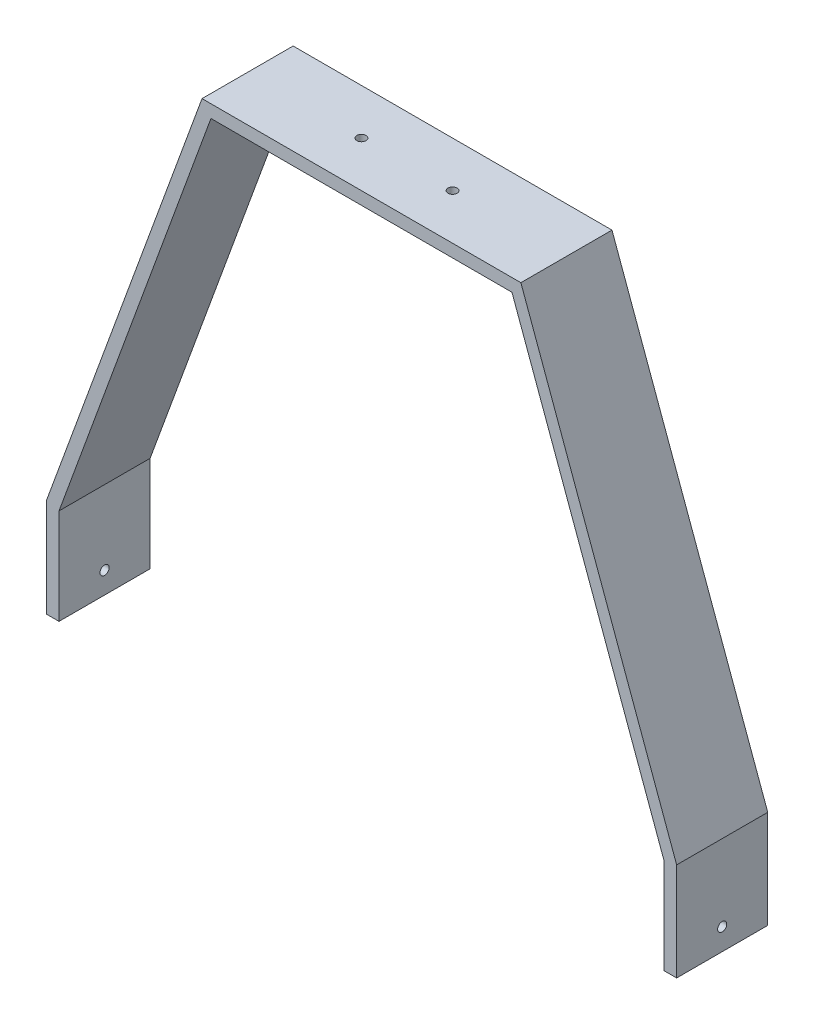
ISO-10303-21;
HEADER;
FILE_DESCRIPTION(('STEP AP214'),'2;1');
FILE_NAME('part.step','',(''),(''),'','','');
FILE_SCHEMA(('AUTOMOTIVE_DESIGN { 1 0 10303 214 1 1 1 1 }'));
ENDSEC;
DATA;
#1=APPLICATION_CONTEXT('core data for automotive mechanical design processes');
#2=APPLICATION_PROTOCOL_DEFINITION('international standard','automotive_design',2000,#1);
#3=PRODUCT_CONTEXT('',#1,'mechanical');
#4=PRODUCT('Part','Part','',(#3));
#5=PRODUCT_RELATED_PRODUCT_CATEGORY('part','',(#4));
#6=PRODUCT_DEFINITION_FORMATION('','',#4);
#7=PRODUCT_DEFINITION_CONTEXT('part definition',#1,'design');
#8=PRODUCT_DEFINITION('design','',#6,#7);
#9=PRODUCT_DEFINITION_SHAPE('','',#8);
#10=(LENGTH_UNIT() NAMED_UNIT(*) SI_UNIT(.MILLI.,.METRE.));
#11=(NAMED_UNIT(*) PLANE_ANGLE_UNIT() SI_UNIT($,.RADIAN.));
#12=(NAMED_UNIT(*) SI_UNIT($,.STERADIAN.) SOLID_ANGLE_UNIT());
#13=UNCERTAINTY_MEASURE_WITH_UNIT(LENGTH_MEASURE(1.E-05),#10,'distance_accuracy_value','');
#14=(GEOMETRIC_REPRESENTATION_CONTEXT(3) GLOBAL_UNCERTAINTY_ASSIGNED_CONTEXT((#13)) GLOBAL_UNIT_ASSIGNED_CONTEXT((#10,
#11,#12)) REPRESENTATION_CONTEXT('',''));
#15=CARTESIAN_POINT('',(0.,0.,0.));
#16=DIRECTION('',(0.,0.,1.));
#17=DIRECTION('',(1.,0.,0.));
#18=AXIS2_PLACEMENT_3D('',#15,#16,#17);
#19=CARTESIAN_POINT('',(0.,0.,50.));
#20=DIRECTION('',(0.,-1.,0.));
#21=DIRECTION('',(0.,0.,-1.));
#22=AXIS2_PLACEMENT_3D('',#19,#20,#21);
#23=PLANE('',#22);
#24=CARTESIAN_POINT('',(112.5,0.,25.));
#25=DIRECTION('',(0.,1.,0.));
#26=DIRECTION('',(0.,0.,1.));
#27=AXIS2_PLACEMENT_3D('',#24,#25,#26);
#28=CIRCLE('',#27,2.5);
#29=CARTESIAN_POINT('',(112.5,0.,27.5));
#30=VERTEX_POINT('',#29);
#31=EDGE_CURVE('E237',#30,#30,#28,.T.);
#32=ORIENTED_EDGE('',*,*,#31,.F.);
#33=EDGE_LOOP('',(#32));
#34=FACE_BOUND('',#33,.T.);
#35=CARTESIAN_POINT('',(62.5,0.,25.));
#36=DIRECTION('',(0.,1.,0.));
#37=DIRECTION('',(0.,0.,1.));
#38=AXIS2_PLACEMENT_3D('',#35,#36,#37);
#39=CIRCLE('',#38,2.5);
#40=CARTESIAN_POINT('',(62.5,0.,27.5));
#41=VERTEX_POINT('',#40);
#42=EDGE_CURVE('E245',#41,#41,#39,.T.);
#43=ORIENTED_EDGE('',*,*,#42,.F.);
#44=EDGE_LOOP('',(#43));
#45=FACE_BOUND('',#44,.T.);
#46=DIRECTION('',(-1.,0.,0.));
#47=VECTOR('',#46,1.);
#48=CARTESIAN_POINT('',(0.,0.,0.));
#49=LINE('',#48,#47);
#50=CARTESIAN_POINT('',(175.,0.,0.));
#51=VERTEX_POINT('',#50);
#52=CARTESIAN_POINT('',(0.,0.,0.));
#53=VERTEX_POINT('',#52);
#54=EDGE_CURVE('E166',#51,#53,#49,.T.);
#55=ORIENTED_EDGE('',*,*,#54,.T.);
#56=DIRECTION('',(0.,0.,-1.));
#57=VECTOR('',#56,1.);
#58=CARTESIAN_POINT('',(0.,0.,50.));
#59=LINE('',#58,#57);
#60=CARTESIAN_POINT('',(0.,0.,50.));
#61=VERTEX_POINT('',#60);
#62=EDGE_CURVE('E11',#61,#53,#59,.T.);
#63=ORIENTED_EDGE('',*,*,#62,.F.);
#64=DIRECTION('',(-1.,0.,0.));
#65=VECTOR('',#64,1.);
#66=CARTESIAN_POINT('',(0.,0.,50.));
#67=LINE('',#66,#65);
#68=CARTESIAN_POINT('',(175.,0.,50.));
#69=VERTEX_POINT('',#68);
#70=EDGE_CURVE('E201',#69,#61,#67,.T.);
#71=ORIENTED_EDGE('',*,*,#70,.F.);
#72=DIRECTION('',(0.,0.,-1.));
#73=VECTOR('',#72,1.);
#74=CARTESIAN_POINT('',(175.,0.,50.));
#75=LINE('',#74,#73);
#76=EDGE_CURVE('E162',#69,#51,#75,.T.);
#77=ORIENTED_EDGE('',*,*,#76,.T.);
#78=EDGE_LOOP('',(#55,#63,#71,#77));
#79=FACE_BOUND('',#78,.T.);
#80=ADVANCED_FACE('F39',(#34,#45,#79),#23,.F.);
#81=CARTESIAN_POINT('',(0.,0.,50.));
#82=DIRECTION('',(0.939264923790738,-0.343192952923539,0.));
#83=DIRECTION('',(0.343192952923539,0.939264923790739,0.));
#84=AXIS2_PLACEMENT_3D('',#81,#82,#83);
#85=PLANE('',#84);
#86=DIRECTION('',(-0.343192952923539,-0.939264923790738,0.));
#87=VECTOR('',#86,1.);
#88=CARTESIAN_POINT('',(0.,0.,0.));
#89=LINE('',#88,#87);
#90=CARTESIAN_POINT('',(-85.5,-234.,0.));
#91=VERTEX_POINT('',#90);
#92=EDGE_CURVE('E170',#53,#91,#89,.T.);
#93=ORIENTED_EDGE('',*,*,#92,.T.);
#94=DIRECTION('',(0.,0.,-1.));
#95=VECTOR('',#94,1.);
#96=CARTESIAN_POINT('',(-85.5,-234.,50.));
#97=LINE('',#96,#95);
#98=CARTESIAN_POINT('',(-85.5,-234.,50.));
#99=VERTEX_POINT('',#98);
#100=EDGE_CURVE('E49',#99,#91,#97,.T.);
#101=ORIENTED_EDGE('',*,*,#100,.F.);
#102=DIRECTION('',(-0.343192952923539,-0.939264923790738,0.));
#103=VECTOR('',#102,1.);
#104=CARTESIAN_POINT('',(0.,0.,50.));
#105=LINE('',#104,#103);
#106=EDGE_CURVE('E113',#61,#99,#105,.T.);
#107=ORIENTED_EDGE('',*,*,#106,.F.);
#108=ORIENTED_EDGE('',*,*,#62,.T.);
#109=EDGE_LOOP('',(#93,#101,#107,#108));
#110=FACE_BOUND('',#109,.T.);
#111=ADVANCED_FACE('F318',(#110),#85,.F.);
#112=CARTESIAN_POINT('',(-85.5,-234.,50.));
#113=DIRECTION('',(1.,0.,0.));
#114=DIRECTION('',(0.,1.,0.));
#115=AXIS2_PLACEMENT_3D('',#112,#113,#114);
#116=PLANE('',#115);
#117=CARTESIAN_POINT('',(-85.5,-275.891246781146,25.));
#118=DIRECTION('',(1.,0.,0.));
#119=DIRECTION('',(0.,0.,-1.));
#120=AXIS2_PLACEMENT_3D('',#117,#118,#119);
#121=CIRCLE('',#120,2.5);
#122=CARTESIAN_POINT('',(-85.5,-275.891246781146,22.5));
#123=VERTEX_POINT('',#122);
#124=EDGE_CURVE('E253',#123,#123,#121,.T.);
#125=ORIENTED_EDGE('',*,*,#124,.T.);
#126=EDGE_LOOP('',(#125));
#127=FACE_BOUND('',#126,.T.);
#128=DIRECTION('',(0.,-1.,0.));
#129=VECTOR('',#128,1.);
#130=CARTESIAN_POINT('',(-85.5,-234.,0.));
#131=LINE('',#130,#129);
#132=CARTESIAN_POINT('',(-85.5,-287.757501625386,0.));
#133=VERTEX_POINT('',#132);
#134=EDGE_CURVE('E174',#91,#133,#131,.T.);
#135=ORIENTED_EDGE('',*,*,#134,.T.);
#136=DIRECTION('',(0.,0.,-1.));
#137=VECTOR('',#136,1.);
#138=CARTESIAN_POINT('',(-85.5,-287.757501625386,50.));
#139=LINE('',#138,#137);
#140=CARTESIAN_POINT('',(-85.5,-287.757501625386,50.));
#141=VERTEX_POINT('',#140);
#142=EDGE_CURVE('E228',#141,#133,#139,.T.);
#143=ORIENTED_EDGE('',*,*,#142,.F.);
#144=DIRECTION('',(0.,-1.,0.));
#145=VECTOR('',#144,1.);
#146=CARTESIAN_POINT('',(-85.5,-234.,50.));
#147=LINE('',#146,#145);
#148=EDGE_CURVE('E271',#99,#141,#147,.T.);
#149=ORIENTED_EDGE('',*,*,#148,.F.);
#150=ORIENTED_EDGE('',*,*,#100,.T.);
#151=EDGE_LOOP('',(#135,#143,#149,#150));
#152=FACE_BOUND('',#151,.T.);
#153=ADVANCED_FACE('F323',(#127,#152),#116,.F.);
#154=CARTESIAN_POINT('',(-85.5,-287.757501625386,50.));
#155=DIRECTION('',(0.,1.,0.));
#156=DIRECTION('',(-1.,0.,0.));
#157=AXIS2_PLACEMENT_3D('',#154,#155,#156);
#158=PLANE('',#157);
#159=DIRECTION('',(1.,0.,0.));
#160=VECTOR('',#159,1.);
#161=CARTESIAN_POINT('',(-85.5,-287.757501625386,0.));
#162=LINE('',#161,#160);
#163=CARTESIAN_POINT('',(-78.5,-287.757501625386,0.));
#164=VERTEX_POINT('',#163);
#165=EDGE_CURVE('E177',#133,#164,#162,.T.);
#166=ORIENTED_EDGE('',*,*,#165,.T.);
#167=DIRECTION('',(0.,0.,-1.));
#168=VECTOR('',#167,1.);
#169=CARTESIAN_POINT('',(-78.5,-287.757501625386,50.));
#170=LINE('',#169,#168);
#171=CARTESIAN_POINT('',(-78.5,-287.757501625386,50.));
#172=VERTEX_POINT('',#171);
#173=EDGE_CURVE('E224',#172,#164,#170,.T.);
#174=ORIENTED_EDGE('',*,*,#173,.F.);
#175=DIRECTION('',(1.,0.,0.));
#176=VECTOR('',#175,1.);
#177=CARTESIAN_POINT('',(-85.5,-287.757501625386,50.));
#178=LINE('',#177,#176);
#179=EDGE_CURVE('E274',#141,#172,#178,.T.);
#180=ORIENTED_EDGE('',*,*,#179,.F.);
#181=ORIENTED_EDGE('',*,*,#142,.T.);
#182=EDGE_LOOP('',(#166,#174,#180,#181));
#183=FACE_BOUND('',#182,.T.);
#184=ADVANCED_FACE('F372',(#183),#158,.F.);
#185=CARTESIAN_POINT('',(-78.5,-235.238794473614,50.));
#186=DIRECTION('',(-1.,0.,0.));
#187=DIRECTION('',(0.,0.,1.));
#188=AXIS2_PLACEMENT_3D('',#185,#186,#187);
#189=PLANE('',#188);
#190=CARTESIAN_POINT('',(-78.5,-275.891246781146,25.));
#191=DIRECTION('',(-1.,0.,0.));
#192=DIRECTION('',(0.,0.,1.));
#193=AXIS2_PLACEMENT_3D('',#190,#191,#192);
#194=CIRCLE('',#193,2.5);
#195=CARTESIAN_POINT('',(-78.5,-275.891246781146,27.5));
#196=VERTEX_POINT('',#195);
#197=EDGE_CURVE('E171',#196,#196,#194,.T.);
#198=ORIENTED_EDGE('',*,*,#197,.T.);
#199=EDGE_LOOP('',(#198));
#200=FACE_BOUND('',#199,.T.);
#201=DIRECTION('',(0.,1.,0.));
#202=VECTOR('',#201,1.);
#203=CARTESIAN_POINT('',(-78.5,-235.238794473614,0.));
#204=LINE('',#203,#202);
#205=CARTESIAN_POINT('',(-78.5,-235.238794473614,0.));
#206=VERTEX_POINT('',#205);
#207=EDGE_CURVE('E180',#164,#206,#204,.T.);
#208=ORIENTED_EDGE('',*,*,#207,.T.);
#209=DIRECTION('',(0.,0.,-1.));
#210=VECTOR('',#209,1.);
#211=CARTESIAN_POINT('',(-78.5,-235.238794473614,50.));
#212=LINE('',#211,#210);
#213=CARTESIAN_POINT('',(-78.5,-235.238794473614,50.));
#214=VERTEX_POINT('',#213);
#215=EDGE_CURVE('E220',#214,#206,#212,.T.);
#216=ORIENTED_EDGE('',*,*,#215,.F.);
#217=DIRECTION('',(0.,1.,0.));
#218=VECTOR('',#217,1.);
#219=CARTESIAN_POINT('',(-78.5,-235.238794473614,50.));
#220=LINE('',#219,#218);
#221=EDGE_CURVE('E277',#172,#214,#220,.T.);
#222=ORIENTED_EDGE('',*,*,#221,.F.);
#223=ORIENTED_EDGE('',*,*,#173,.T.);
#224=EDGE_LOOP('',(#208,#216,#222,#223));
#225=FACE_BOUND('',#224,.T.);
#226=ADVANCED_FACE('F368',(#200,#225),#189,.F.);
#227=CARTESIAN_POINT('',(4.8949441345896,-7.00000000000002,50.));
#228=DIRECTION('',(-0.939264923790739,0.343192952923539,0.));
#229=DIRECTION('',(-0.343192952923539,-0.939264923790738,0.));
#230=AXIS2_PLACEMENT_3D('',#227,#228,#229);
#231=PLANE('',#230);
#232=DIRECTION('',(0.343192952923539,0.939264923790738,0.));
#233=VECTOR('',#232,1.);
#234=CARTESIAN_POINT('',(4.8949441345896,-7.00000000000002,0.));
#235=LINE('',#234,#233);
#236=CARTESIAN_POINT('',(4.8949441345896,-7.00000000000002,0.));
#237=VERTEX_POINT('',#236);
#238=EDGE_CURVE('E183',#206,#237,#235,.T.);
#239=ORIENTED_EDGE('',*,*,#238,.T.);
#240=DIRECTION('',(0.,0.,-1.));
#241=VECTOR('',#240,1.);
#242=CARTESIAN_POINT('',(4.8949441345896,-7.00000000000002,50.));
#243=LINE('',#242,#241);
#244=CARTESIAN_POINT('',(4.8949441345896,-7.00000000000002,50.));
#245=VERTEX_POINT('',#244);
#246=EDGE_CURVE('E216',#245,#237,#243,.T.);
#247=ORIENTED_EDGE('',*,*,#246,.F.);
#248=DIRECTION('',(0.343192952923539,0.939264923790738,0.));
#249=VECTOR('',#248,1.);
#250=CARTESIAN_POINT('',(4.8949441345896,-7.00000000000002,50.));
#251=LINE('',#250,#249);
#252=EDGE_CURVE('E280',#214,#245,#251,.T.);
#253=ORIENTED_EDGE('',*,*,#252,.F.);
#254=ORIENTED_EDGE('',*,*,#215,.T.);
#255=EDGE_LOOP('',(#239,#247,#253,#254));
#256=FACE_BOUND('',#255,.T.);
#257=ADVANCED_FACE('F364',(#256),#231,.F.);
#258=CARTESIAN_POINT('',(170.10505586541,-7.00000000000002,50.));
#259=DIRECTION('',(0.,1.,0.));
#260=DIRECTION('',(0.,0.,1.));
#261=AXIS2_PLACEMENT_3D('',#258,#259,#260);
#262=PLANE('',#261);
#263=CARTESIAN_POINT('',(112.5,-7.00000000000001,25.));
#264=DIRECTION('',(0.,1.,0.));
#265=DIRECTION('',(0.,0.,1.));
#266=AXIS2_PLACEMENT_3D('',#263,#264,#265);
#267=CIRCLE('',#266,2.5);
#268=CARTESIAN_POINT('',(112.5,-7.00000000000001,27.5));
#269=VERTEX_POINT('',#268);
#270=EDGE_CURVE('E42',#269,#269,#267,.T.);
#271=ORIENTED_EDGE('',*,*,#270,.T.);
#272=EDGE_LOOP('',(#271));
#273=FACE_BOUND('',#272,.T.);
#274=CARTESIAN_POINT('',(62.5,-7.00000000000001,25.));
#275=DIRECTION('',(0.,1.,0.));
#276=DIRECTION('',(0.,0.,1.));
#277=AXIS2_PLACEMENT_3D('',#274,#275,#276);
#278=CIRCLE('',#277,2.5);
#279=CARTESIAN_POINT('',(62.5,-7.00000000000001,27.5));
#280=VERTEX_POINT('',#279);
#281=EDGE_CURVE('E234',#280,#280,#278,.T.);
#282=ORIENTED_EDGE('',*,*,#281,.T.);
#283=EDGE_LOOP('',(#282));
#284=FACE_BOUND('',#283,.T.);
#285=DIRECTION('',(1.,0.,0.));
#286=VECTOR('',#285,1.);
#287=CARTESIAN_POINT('',(170.10505586541,-7.00000000000002,0.));
#288=LINE('',#287,#286);
#289=CARTESIAN_POINT('',(170.10505586541,-7.00000000000002,0.));
#290=VERTEX_POINT('',#289);
#291=EDGE_CURVE('E186',#237,#290,#288,.T.);
#292=ORIENTED_EDGE('',*,*,#291,.T.);
#293=DIRECTION('',(0.,0.,-1.));
#294=VECTOR('',#293,1.);
#295=CARTESIAN_POINT('',(170.10505586541,-7.00000000000002,50.));
#296=LINE('',#295,#294);
#297=CARTESIAN_POINT('',(170.10505586541,-7.00000000000002,50.));
#298=VERTEX_POINT('',#297);
#299=EDGE_CURVE('E212',#298,#290,#296,.T.);
#300=ORIENTED_EDGE('',*,*,#299,.F.);
#301=DIRECTION('',(1.,0.,0.));
#302=VECTOR('',#301,1.);
#303=CARTESIAN_POINT('',(170.10505586541,-7.00000000000002,50.));
#304=LINE('',#303,#302);
#305=EDGE_CURVE('E283',#245,#298,#304,.T.);
#306=ORIENTED_EDGE('',*,*,#305,.F.);
#307=ORIENTED_EDGE('',*,*,#246,.T.);
#308=EDGE_LOOP('',(#292,#300,#306,#307));
#309=FACE_BOUND('',#308,.T.);
#310=ADVANCED_FACE('F359',(#273,#284,#309),#262,.F.);
#311=CARTESIAN_POINT('',(170.10505586541,-7.00000000000002,50.));
#312=DIRECTION('',(0.939264923790738,0.343192952923539,0.));
#313=DIRECTION('',(-0.343192952923539,0.939264923790738,0.));
#314=AXIS2_PLACEMENT_3D('',#311,#312,#313);
#315=PLANE('',#314);
#316=DIRECTION('',(0.343192952923539,-0.939264923790738,0.));
#317=VECTOR('',#316,1.);
#318=CARTESIAN_POINT('',(170.10505586541,-7.00000000000002,0.));
#319=LINE('',#318,#317);
#320=CARTESIAN_POINT('',(253.5,-235.238794473614,0.));
#321=VERTEX_POINT('',#320);
#322=EDGE_CURVE('E189',#290,#321,#319,.T.);
#323=ORIENTED_EDGE('',*,*,#322,.T.);
#324=DIRECTION('',(0.,0.,-1.));
#325=VECTOR('',#324,1.);
#326=CARTESIAN_POINT('',(253.5,-235.238794473614,50.));
#327=LINE('',#326,#325);
#328=CARTESIAN_POINT('',(253.5,-235.238794473614,50.));
#329=VERTEX_POINT('',#328);
#330=EDGE_CURVE('E208',#329,#321,#327,.T.);
#331=ORIENTED_EDGE('',*,*,#330,.F.);
#332=DIRECTION('',(0.343192952923539,-0.939264923790738,0.));
#333=VECTOR('',#332,1.);
#334=CARTESIAN_POINT('',(170.10505586541,-7.00000000000002,50.));
#335=LINE('',#334,#333);
#336=EDGE_CURVE('E286',#298,#329,#335,.T.);
#337=ORIENTED_EDGE('',*,*,#336,.F.);
#338=ORIENTED_EDGE('',*,*,#299,.T.);
#339=EDGE_LOOP('',(#323,#331,#337,#338));
#340=FACE_BOUND('',#339,.T.);
#341=ADVANCED_FACE('F294',(#340),#315,.F.);
#342=CARTESIAN_POINT('',(253.5,-235.238794473614,50.));
#343=DIRECTION('',(1.,0.,0.));
#344=DIRECTION('',(0.,0.,-1.));
#345=AXIS2_PLACEMENT_3D('',#342,#343,#344);
#346=PLANE('',#345);
#347=CARTESIAN_POINT('',(253.5,-275.891246781146,25.));
#348=DIRECTION('',(1.,0.,0.));
#349=DIRECTION('',(0.,0.,-1.));
#350=AXIS2_PLACEMENT_3D('',#347,#348,#349);
#351=CIRCLE('',#350,2.5);
#352=CARTESIAN_POINT('',(253.5,-275.891246781146,22.5));
#353=VERTEX_POINT('',#352);
#354=EDGE_CURVE('E257',#353,#353,#351,.T.);
#355=ORIENTED_EDGE('',*,*,#354,.T.);
#356=EDGE_LOOP('',(#355));
#357=FACE_BOUND('',#356,.T.);
#358=DIRECTION('',(0.,-1.,0.));
#359=VECTOR('',#358,1.);
#360=CARTESIAN_POINT('',(253.5,-235.238794473614,0.));
#361=LINE('',#360,#359);
#362=CARTESIAN_POINT('',(253.5,-287.757501625386,0.));
#363=VERTEX_POINT('',#362);
#364=EDGE_CURVE('E192',#321,#363,#361,.T.);
#365=ORIENTED_EDGE('',*,*,#364,.T.);
#366=DIRECTION('',(0.,0.,-1.));
#367=VECTOR('',#366,1.);
#368=CARTESIAN_POINT('',(253.5,-287.757501625386,50.));
#369=LINE('',#368,#367);
#370=CARTESIAN_POINT('',(253.5,-287.757501625386,50.));
#371=VERTEX_POINT('',#370);
#372=EDGE_CURVE('E155',#371,#363,#369,.T.);
#373=ORIENTED_EDGE('',*,*,#372,.F.);
#374=DIRECTION('',(0.,-1.,0.));
#375=VECTOR('',#374,1.);
#376=CARTESIAN_POINT('',(253.5,-235.238794473614,50.));
#377=LINE('',#376,#375);
#378=EDGE_CURVE('E144',#329,#371,#377,.T.);
#379=ORIENTED_EDGE('',*,*,#378,.F.);
#380=ORIENTED_EDGE('',*,*,#330,.T.);
#381=EDGE_LOOP('',(#365,#373,#379,#380));
#382=FACE_BOUND('',#381,.T.);
#383=ADVANCED_FACE('F298',(#357,#382),#346,.F.);
#384=CARTESIAN_POINT('',(260.5,-287.757501625386,50.));
#385=DIRECTION('',(0.,1.,0.));
#386=DIRECTION('',(0.,0.,1.));
#387=AXIS2_PLACEMENT_3D('',#384,#385,#386);
#388=PLANE('',#387);
#389=DIRECTION('',(1.,0.,0.));
#390=VECTOR('',#389,1.);
#391=CARTESIAN_POINT('',(260.5,-287.757501625386,0.));
#392=LINE('',#391,#390);
#393=CARTESIAN_POINT('',(260.5,-287.757501625386,0.));
#394=VERTEX_POINT('',#393);
#395=EDGE_CURVE('E153',#363,#394,#392,.T.);
#396=ORIENTED_EDGE('',*,*,#395,.T.);
#397=DIRECTION('',(0.,0.,-1.));
#398=VECTOR('',#397,1.);
#399=CARTESIAN_POINT('',(260.5,-287.757501625386,50.));
#400=LINE('',#399,#398);
#401=CARTESIAN_POINT('',(260.5,-287.757501625386,50.));
#402=VERTEX_POINT('',#401);
#403=EDGE_CURVE('E150',#402,#394,#400,.T.);
#404=ORIENTED_EDGE('',*,*,#403,.F.);
#405=DIRECTION('',(1.,0.,0.));
#406=VECTOR('',#405,1.);
#407=CARTESIAN_POINT('',(260.5,-287.757501625386,50.));
#408=LINE('',#407,#406);
#409=EDGE_CURVE('E138',#371,#402,#408,.T.);
#410=ORIENTED_EDGE('',*,*,#409,.F.);
#411=ORIENTED_EDGE('',*,*,#372,.T.);
#412=EDGE_LOOP('',(#396,#404,#410,#411));
#413=FACE_BOUND('',#412,.T.);
#414=ADVANCED_FACE('F151',(#413),#388,.F.);
#415=CARTESIAN_POINT('',(260.5,-234.,50.));
#416=DIRECTION('',(-1.,0.,0.));
#417=DIRECTION('',(0.,0.,1.));
#418=AXIS2_PLACEMENT_3D('',#415,#416,#417);
#419=PLANE('',#418);
#420=CARTESIAN_POINT('',(260.5,-275.891246781146,25.));
#421=DIRECTION('',(1.,0.,0.));
#422=DIRECTION('',(0.,0.,-1.));
#423=AXIS2_PLACEMENT_3D('',#420,#421,#422);
#424=CIRCLE('',#423,2.5);
#425=CARTESIAN_POINT('',(260.5,-275.891246781146,22.5));
#426=VERTEX_POINT('',#425);
#427=EDGE_CURVE('E243',#426,#426,#424,.T.);
#428=ORIENTED_EDGE('',*,*,#427,.F.);
#429=EDGE_LOOP('',(#428));
#430=FACE_BOUND('',#429,.T.);
#431=DIRECTION('',(0.,1.,0.));
#432=VECTOR('',#431,1.);
#433=CARTESIAN_POINT('',(260.5,-234.,0.));
#434=LINE('',#433,#432);
#435=CARTESIAN_POINT('',(260.5,-234.,0.));
#436=VERTEX_POINT('',#435);
#437=EDGE_CURVE('E99',#394,#436,#434,.T.);
#438=ORIENTED_EDGE('',*,*,#437,.T.);
#439=DIRECTION('',(0.,0.,-1.));
#440=VECTOR('',#439,1.);
#441=CARTESIAN_POINT('',(260.5,-234.,50.));
#442=LINE('',#441,#440);
#443=CARTESIAN_POINT('',(260.5,-234.,50.));
#444=VERTEX_POINT('',#443);
#445=EDGE_CURVE('E156',#444,#436,#442,.T.);
#446=ORIENTED_EDGE('',*,*,#445,.F.);
#447=DIRECTION('',(0.,1.,0.));
#448=VECTOR('',#447,1.);
#449=CARTESIAN_POINT('',(260.5,-234.,50.));
#450=LINE('',#449,#448);
#451=EDGE_CURVE('E142',#402,#444,#450,.T.);
#452=ORIENTED_EDGE('',*,*,#451,.F.);
#453=ORIENTED_EDGE('',*,*,#403,.T.);
#454=EDGE_LOOP('',(#438,#446,#452,#453));
#455=FACE_BOUND('',#454,.T.);
#456=ADVANCED_FACE('F158',(#430,#455),#419,.F.);
#457=CARTESIAN_POINT('',(175.,0.,50.));
#458=DIRECTION('',(-0.939264923790738,-0.343192952923539,0.));
#459=DIRECTION('',(0.343192952923539,-0.939264923790738,0.));
#460=AXIS2_PLACEMENT_3D('',#457,#458,#459);
#461=PLANE('',#460);
#462=DIRECTION('',(-0.343192952923539,0.939264923790738,0.));
#463=VECTOR('',#462,1.);
#464=CARTESIAN_POINT('',(175.,0.,0.));
#465=LINE('',#464,#463);
#466=EDGE_CURVE('E105',#436,#51,#465,.T.);
#467=ORIENTED_EDGE('',*,*,#466,.T.);
#468=ORIENTED_EDGE('',*,*,#76,.F.);
#469=DIRECTION('',(-0.343192952923539,0.939264923790738,0.));
#470=VECTOR('',#469,1.);
#471=CARTESIAN_POINT('',(175.,0.,50.));
#472=LINE('',#471,#470);
#473=EDGE_CURVE('E58',#444,#69,#472,.T.);
#474=ORIENTED_EDGE('',*,*,#473,.F.);
#475=ORIENTED_EDGE('',*,*,#445,.T.);
#476=EDGE_LOOP('',(#467,#468,#474,#475));
#477=FACE_BOUND('',#476,.T.);
#478=ADVANCED_FACE('F306',(#477),#461,.F.);
#479=CARTESIAN_POINT('',(0.,0.,50.));
#480=DIRECTION('',(0.,0.,-1.));
#481=DIRECTION('',(-1.,0.,0.));
#482=AXIS2_PLACEMENT_3D('',#479,#480,#481);
#483=PLANE('',#482);
#484=ORIENTED_EDGE('',*,*,#70,.T.);
#485=ORIENTED_EDGE('',*,*,#106,.T.);
#486=ORIENTED_EDGE('',*,*,#148,.T.);
#487=ORIENTED_EDGE('',*,*,#179,.T.);
#488=ORIENTED_EDGE('',*,*,#221,.T.);
#489=ORIENTED_EDGE('',*,*,#252,.T.);
#490=ORIENTED_EDGE('',*,*,#305,.T.);
#491=ORIENTED_EDGE('',*,*,#336,.T.);
#492=ORIENTED_EDGE('',*,*,#378,.T.);
#493=ORIENTED_EDGE('',*,*,#409,.T.);
#494=ORIENTED_EDGE('',*,*,#451,.T.);
#495=ORIENTED_EDGE('',*,*,#473,.T.);
#496=EDGE_LOOP('',(#484,#485,#486,#487,#488,#489,#490,#491,#492,#493,#494,#495));
#497=FACE_BOUND('',#496,.T.);
#498=ADVANCED_FACE('F140',(#497),#483,.F.);
#499=CARTESIAN_POINT('',(0.,0.,0.));
#500=DIRECTION('',(0.,0.,-1.));
#501=DIRECTION('',(-1.,0.,0.));
#502=AXIS2_PLACEMENT_3D('',#499,#500,#501);
#503=PLANE('',#502);
#504=ORIENTED_EDGE('',*,*,#54,.F.);
#505=ORIENTED_EDGE('',*,*,#466,.F.);
#506=ORIENTED_EDGE('',*,*,#437,.F.);
#507=ORIENTED_EDGE('',*,*,#395,.F.);
#508=ORIENTED_EDGE('',*,*,#364,.F.);
#509=ORIENTED_EDGE('',*,*,#322,.F.);
#510=ORIENTED_EDGE('',*,*,#291,.F.);
#511=ORIENTED_EDGE('',*,*,#238,.F.);
#512=ORIENTED_EDGE('',*,*,#207,.F.);
#513=ORIENTED_EDGE('',*,*,#165,.F.);
#514=ORIENTED_EDGE('',*,*,#134,.F.);
#515=ORIENTED_EDGE('',*,*,#92,.F.);
#516=EDGE_LOOP('',(#504,#505,#506,#507,#508,#509,#510,#511,#512,#513,#514,#515));
#517=FACE_BOUND('',#516,.T.);
#518=ADVANCED_FACE('F301',(#517),#503,.T.);
#519=CARTESIAN_POINT('',(-85.5,-275.891246781146,25.));
#520=DIRECTION('',(1.,0.,0.));
#521=DIRECTION('',(0.,0.,-1.));
#522=AXIS2_PLACEMENT_3D('',#519,#520,#521);
#523=CYLINDRICAL_SURFACE('',#522,2.5);
#524=ORIENTED_EDGE('',*,*,#427,.T.);
#525=EDGE_LOOP('',(#524));
#526=FACE_BOUND('',#525,.T.);
#527=ORIENTED_EDGE('',*,*,#354,.F.);
#528=EDGE_LOOP('',(#527));
#529=FACE_BOUND('',#528,.T.);
#530=ADVANCED_FACE('F338',(#526,#529),#523,.F.);
#531=ORIENTED_EDGE('',*,*,#124,.F.);
#532=EDGE_LOOP('',(#531));
#533=FACE_BOUND('',#532,.T.);
#534=ORIENTED_EDGE('',*,*,#197,.F.);
#535=EDGE_LOOP('',(#534));
#536=FACE_BOUND('',#535,.T.);
#537=ADVANCED_FACE('F331',(#533,#536),#523,.F.);
#538=CARTESIAN_POINT('',(62.5,-287.757501625386,25.));
#539=DIRECTION('',(0.,1.,0.));
#540=DIRECTION('',(0.,0.,1.));
#541=AXIS2_PLACEMENT_3D('',#538,#539,#540);
#542=CYLINDRICAL_SURFACE('',#541,2.5);
#543=ORIENTED_EDGE('',*,*,#42,.T.);
#544=EDGE_LOOP('',(#543));
#545=FACE_BOUND('',#544,.T.);
#546=ORIENTED_EDGE('',*,*,#281,.F.);
#547=EDGE_LOOP('',(#546));
#548=FACE_BOUND('',#547,.T.);
#549=ADVANCED_FACE('F327',(#545,#548),#542,.F.);
#550=CARTESIAN_POINT('',(112.5,-287.757501625386,25.));
#551=DIRECTION('',(0.,1.,0.));
#552=DIRECTION('',(0.,0.,1.));
#553=AXIS2_PLACEMENT_3D('',#550,#551,#552);
#554=CYLINDRICAL_SURFACE('',#553,2.5);
#555=ORIENTED_EDGE('',*,*,#31,.T.);
#556=EDGE_LOOP('',(#555));
#557=FACE_BOUND('',#556,.T.);
#558=ORIENTED_EDGE('',*,*,#270,.F.);
#559=EDGE_LOOP('',(#558));
#560=FACE_BOUND('',#559,.T.);
#561=ADVANCED_FACE('F330',(#557,#560),#554,.F.);
#562=CLOSED_SHELL('',(#80,#111,#153,#184,#226,#257,#310,#341,#383,#414,#456,#478,#498,#518,#530,
#537,#549,#561));
#563=MANIFOLD_SOLID_BREP('B2',#562);
#564=ADVANCED_BREP_SHAPE_REPRESENTATION('',(#18,#563),#14);
#565=SHAPE_DEFINITION_REPRESENTATION(#9,#564);
ENDSEC;
END-ISO-10303-21;
